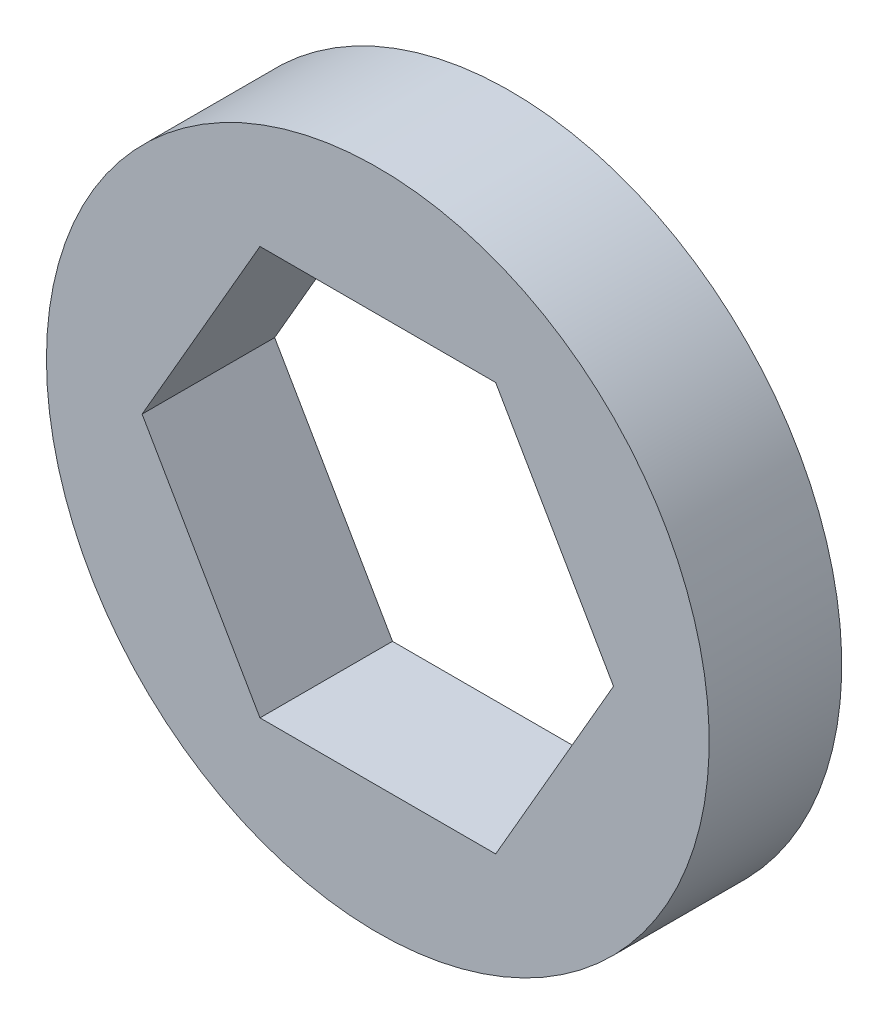
ISO-10303-21;
HEADER;
FILE_DESCRIPTION(('STEP AP214'),'2;1');
FILE_NAME('part.step','',(''),(''),'','','');
FILE_SCHEMA(('AUTOMOTIVE_DESIGN { 1 0 10303 214 1 1 1 1 }'));
ENDSEC;
DATA;
#1=APPLICATION_CONTEXT('core data for automotive mechanical design processes');
#2=APPLICATION_PROTOCOL_DEFINITION('international standard','automotive_design',2000,#1);
#3=PRODUCT_CONTEXT('',#1,'mechanical');
#4=PRODUCT('Part','Part','',(#3));
#5=PRODUCT_RELATED_PRODUCT_CATEGORY('part','',(#4));
#6=PRODUCT_DEFINITION_FORMATION('','',#4);
#7=PRODUCT_DEFINITION_CONTEXT('part definition',#1,'design');
#8=PRODUCT_DEFINITION('design','',#6,#7);
#9=PRODUCT_DEFINITION_SHAPE('','',#8);
#10=(LENGTH_UNIT() NAMED_UNIT(*) SI_UNIT(.MILLI.,.METRE.));
#11=(NAMED_UNIT(*) PLANE_ANGLE_UNIT() SI_UNIT($,.RADIAN.));
#12=(NAMED_UNIT(*) SI_UNIT($,.STERADIAN.) SOLID_ANGLE_UNIT());
#13=UNCERTAINTY_MEASURE_WITH_UNIT(LENGTH_MEASURE(1.E-05),#10,'distance_accuracy_value','');
#14=(GEOMETRIC_REPRESENTATION_CONTEXT(3) GLOBAL_UNCERTAINTY_ASSIGNED_CONTEXT((#13)) GLOBAL_UNIT_ASSIGNED_CONTEXT((#10,
#11,#12)) REPRESENTATION_CONTEXT('',''));
#15=CARTESIAN_POINT('',(0.,0.,0.));
#16=DIRECTION('',(0.,0.,1.));
#17=DIRECTION('',(1.,0.,0.));
#18=AXIS2_PLACEMENT_3D('',#15,#16,#17);
#19=CARTESIAN_POINT('',(0.,0.,-1.5875));
#20=DIRECTION('',(0.,0.,1.));
#21=DIRECTION('',(1.,0.,0.));
#22=AXIS2_PLACEMENT_3D('',#19,#20,#21);
#23=PLANE('',#22);
#24=DIRECTION('',(-0.5,-0.866025403784439,0.));
#25=VECTOR('',#24,1.);
#26=CARTESIAN_POINT('',(2.82295414120268,-4.8895,-1.5875));
#27=LINE('',#26,#25);
#28=CARTESIAN_POINT('',(5.64590828240535,0.,-1.5875));
#29=VERTEX_POINT('',#28);
#30=CARTESIAN_POINT('',(2.82295414120268,-4.8895,-1.5875));
#31=VERTEX_POINT('',#30);
#32=EDGE_CURVE('E74',#29,#31,#27,.T.);
#33=ORIENTED_EDGE('',*,*,#32,.F.);
#34=DIRECTION('',(0.500000000000001,-0.866025403784438,0.));
#35=VECTOR('',#34,1.);
#36=CARTESIAN_POINT('',(5.64590828240535,0.,-1.5875));
#37=LINE('',#36,#35);
#38=CARTESIAN_POINT('',(2.82295414120267,4.8895,-1.5875));
#39=VERTEX_POINT('',#38);
#40=EDGE_CURVE('E104',#39,#29,#37,.T.);
#41=ORIENTED_EDGE('',*,*,#40,.F.);
#42=DIRECTION('',(1.,0.,0.));
#43=VECTOR('',#42,1.);
#44=CARTESIAN_POINT('',(2.82295414120267,4.8895,-1.5875));
#45=LINE('',#44,#43);
#46=CARTESIAN_POINT('',(-2.82295414120268,4.8895,-1.5875));
#47=VERTEX_POINT('',#46);
#48=EDGE_CURVE('E112',#47,#39,#45,.T.);
#49=ORIENTED_EDGE('',*,*,#48,.F.);
#50=DIRECTION('',(0.5,0.866025403784439,0.));
#51=VECTOR('',#50,1.);
#52=CARTESIAN_POINT('',(-2.82295414120268,4.8895,-1.5875));
#53=LINE('',#52,#51);
#54=CARTESIAN_POINT('',(-5.64590828240535,0.,-1.5875));
#55=VERTEX_POINT('',#54);
#56=EDGE_CURVE('E117',#55,#47,#53,.T.);
#57=ORIENTED_EDGE('',*,*,#56,.F.);
#58=DIRECTION('',(-0.5,0.866025403784439,0.));
#59=VECTOR('',#58,1.);
#60=CARTESIAN_POINT('',(-5.64590828240535,0.,-1.5875));
#61=LINE('',#60,#59);
#62=CARTESIAN_POINT('',(-2.82295414120268,-4.8895,-1.5875));
#63=VERTEX_POINT('',#62);
#64=EDGE_CURVE('E69',#63,#55,#61,.T.);
#65=ORIENTED_EDGE('',*,*,#64,.F.);
#66=DIRECTION('',(-1.,0.,0.));
#67=VECTOR('',#66,1.);
#68=CARTESIAN_POINT('',(-2.82295414120268,-4.8895,-1.5875));
#69=LINE('',#68,#67);
#70=EDGE_CURVE('E71',#31,#63,#69,.T.);
#71=ORIENTED_EDGE('',*,*,#70,.F.);
#72=EDGE_LOOP('',(#33,#41,#49,#57,#65,#71));
#73=FACE_BOUND('',#72,.T.);
#74=CARTESIAN_POINT('',(0.,0.,-1.5875));
#75=DIRECTION('',(0.,0.,-1.));
#76=DIRECTION('',(-1.,0.,0.));
#77=AXIS2_PLACEMENT_3D('',#74,#75,#76);
#78=CIRCLE('',#77,7.9375);
#79=CARTESIAN_POINT('',(-7.9375,0.,-1.5875));
#80=VERTEX_POINT('',#79);
#81=EDGE_CURVE('E21',#80,#80,#78,.F.);
#82=ORIENTED_EDGE('',*,*,#81,.F.);
#83=EDGE_LOOP('',(#82));
#84=FACE_BOUND('',#83,.T.);
#85=ADVANCED_FACE('F18',(#73,#84),#23,.F.);
#86=CARTESIAN_POINT('',(0.,0.,1.5875));
#87=DIRECTION('',(0.,0.,-1.));
#88=DIRECTION('',(-1.,0.,0.));
#89=AXIS2_PLACEMENT_3D('',#86,#87,#88);
#90=CYLINDRICAL_SURFACE('',#89,7.9375);
#91=ORIENTED_EDGE('',*,*,#81,.T.);
#92=EDGE_LOOP('',(#91));
#93=FACE_BOUND('',#92,.T.);
#94=CARTESIAN_POINT('',(0.,0.,1.5875));
#95=DIRECTION('',(0.,0.,-1.));
#96=DIRECTION('',(-1.,0.,0.));
#97=AXIS2_PLACEMENT_3D('',#94,#95,#96);
#98=CIRCLE('',#97,7.9375);
#99=CARTESIAN_POINT('',(-7.9375,0.,1.5875));
#100=VERTEX_POINT('',#99);
#101=EDGE_CURVE('E96',#100,#100,#98,.F.);
#102=ORIENTED_EDGE('',*,*,#101,.F.);
#103=EDGE_LOOP('',(#102));
#104=FACE_BOUND('',#103,.T.);
#105=ADVANCED_FACE('F154',(#93,#104),#90,.T.);
#106=CARTESIAN_POINT('',(2.82295414120268,-4.8895,1.5875));
#107=DIRECTION('',(-0.866025403784439,0.5,0.));
#108=DIRECTION('',(-0.5,-0.866025403784439,0.));
#109=AXIS2_PLACEMENT_3D('',#106,#107,#108);
#110=PLANE('',#109);
#111=DIRECTION('',(-0.5,-0.866025403784439,0.));
#112=VECTOR('',#111,1.);
#113=CARTESIAN_POINT('',(5.64590828240535,0.,1.5875));
#114=LINE('',#113,#112);
#115=CARTESIAN_POINT('',(5.64590828240535,0.,1.5875));
#116=VERTEX_POINT('',#115);
#117=CARTESIAN_POINT('',(2.82295414120268,-4.8895,1.5875));
#118=VERTEX_POINT('',#117);
#119=EDGE_CURVE('E98',#116,#118,#114,.T.);
#120=ORIENTED_EDGE('',*,*,#119,.F.);
#121=DIRECTION('',(0.,0.,1.));
#122=VECTOR('',#121,1.);
#123=CARTESIAN_POINT('',(5.64590828240535,0.,1.5875));
#124=LINE('',#123,#122);
#125=EDGE_CURVE('E85',#29,#116,#124,.T.);
#126=ORIENTED_EDGE('',*,*,#125,.F.);
#127=ORIENTED_EDGE('',*,*,#32,.T.);
#128=DIRECTION('',(0.,0.,1.));
#129=VECTOR('',#128,1.);
#130=CARTESIAN_POINT('',(2.82295414120268,-4.8895,1.5875));
#131=LINE('',#130,#129);
#132=EDGE_CURVE('E79',#118,#31,#131,.F.);
#133=ORIENTED_EDGE('',*,*,#132,.F.);
#134=EDGE_LOOP('',(#120,#126,#127,#133));
#135=FACE_BOUND('',#134,.T.);
#136=ADVANCED_FACE('F82',(#135),#110,.T.);
#137=CARTESIAN_POINT('',(-2.82295414120268,-4.8895,1.5875));
#138=DIRECTION('',(0.,1.,0.));
#139=DIRECTION('',(-1.,0.,0.));
#140=AXIS2_PLACEMENT_3D('',#137,#138,#139);
#141=PLANE('',#140);
#142=DIRECTION('',(1.,0.,0.));
#143=VECTOR('',#142,1.);
#144=CARTESIAN_POINT('',(0.,-4.8895,1.5875));
#145=LINE('',#144,#143);
#146=CARTESIAN_POINT('',(-2.82295414120268,-4.8895,1.5875));
#147=VERTEX_POINT('',#146);
#148=EDGE_CURVE('E90',#118,#147,#145,.F.);
#149=ORIENTED_EDGE('',*,*,#148,.F.);
#150=ORIENTED_EDGE('',*,*,#132,.T.);
#151=ORIENTED_EDGE('',*,*,#70,.T.);
#152=DIRECTION('',(0.,0.,1.));
#153=VECTOR('',#152,1.);
#154=CARTESIAN_POINT('',(-2.82295414120268,-4.8895,1.5875));
#155=LINE('',#154,#153);
#156=EDGE_CURVE('E93',#147,#63,#155,.F.);
#157=ORIENTED_EDGE('',*,*,#156,.F.);
#158=EDGE_LOOP('',(#149,#150,#151,#157));
#159=FACE_BOUND('',#158,.T.);
#160=ADVANCED_FACE('F88',(#159),#141,.T.);
#161=CARTESIAN_POINT('',(-5.64590828240535,0.,1.5875));
#162=DIRECTION('',(0.866025403784439,0.5,0.));
#163=DIRECTION('',(-0.5,0.866025403784439,0.));
#164=AXIS2_PLACEMENT_3D('',#161,#162,#163);
#165=PLANE('',#164);
#166=DIRECTION('',(-0.5,0.866025403784439,0.));
#167=VECTOR('',#166,1.);
#168=CARTESIAN_POINT('',(-2.82295414120268,-4.8895,1.5875));
#169=LINE('',#168,#167);
#170=CARTESIAN_POINT('',(-5.64590828240535,0.,1.5875));
#171=VERTEX_POINT('',#170);
#172=EDGE_CURVE('E123',#147,#171,#169,.T.);
#173=ORIENTED_EDGE('',*,*,#172,.F.);
#174=ORIENTED_EDGE('',*,*,#156,.T.);
#175=ORIENTED_EDGE('',*,*,#64,.T.);
#176=DIRECTION('',(0.,0.,1.));
#177=VECTOR('',#176,1.);
#178=CARTESIAN_POINT('',(-5.64590828240535,0.,1.5875));
#179=LINE('',#178,#177);
#180=EDGE_CURVE('E114',#171,#55,#179,.F.);
#181=ORIENTED_EDGE('',*,*,#180,.F.);
#182=EDGE_LOOP('',(#173,#174,#175,#181));
#183=FACE_BOUND('',#182,.T.);
#184=ADVANCED_FACE('F121',(#183),#165,.T.);
#185=CARTESIAN_POINT('',(-2.82295414120268,4.8895,1.5875));
#186=DIRECTION('',(0.866025403784439,-0.5,0.));
#187=DIRECTION('',(0.5,0.866025403784439,0.));
#188=AXIS2_PLACEMENT_3D('',#185,#186,#187);
#189=PLANE('',#188);
#190=DIRECTION('',(0.5,0.866025403784439,0.));
#191=VECTOR('',#190,1.);
#192=CARTESIAN_POINT('',(-5.64590828240535,0.,1.5875));
#193=LINE('',#192,#191);
#194=CARTESIAN_POINT('',(-2.82295414120268,4.8895,1.5875));
#195=VERTEX_POINT('',#194);
#196=EDGE_CURVE('E127',#171,#195,#193,.T.);
#197=ORIENTED_EDGE('',*,*,#196,.F.);
#198=ORIENTED_EDGE('',*,*,#180,.T.);
#199=ORIENTED_EDGE('',*,*,#56,.T.);
#200=DIRECTION('',(0.,0.,1.));
#201=VECTOR('',#200,1.);
#202=CARTESIAN_POINT('',(-2.82295414120268,4.8895,1.5875));
#203=LINE('',#202,#201);
#204=EDGE_CURVE('E109',#195,#47,#203,.F.);
#205=ORIENTED_EDGE('',*,*,#204,.F.);
#206=EDGE_LOOP('',(#197,#198,#199,#205));
#207=FACE_BOUND('',#206,.T.);
#208=ADVANCED_FACE('F135',(#207),#189,.T.);
#209=CARTESIAN_POINT('',(2.82295414120267,4.8895,1.5875));
#210=DIRECTION('',(0.,-1.,0.));
#211=DIRECTION('',(1.,0.,0.));
#212=AXIS2_PLACEMENT_3D('',#209,#210,#211);
#213=PLANE('',#212);
#214=DIRECTION('',(1.,0.,0.));
#215=VECTOR('',#214,1.);
#216=CARTESIAN_POINT('',(0.,4.8895,1.5875));
#217=LINE('',#216,#215);
#218=CARTESIAN_POINT('',(2.82295414120267,4.8895,1.5875));
#219=VERTEX_POINT('',#218);
#220=EDGE_CURVE('E27',#195,#219,#217,.T.);
#221=ORIENTED_EDGE('',*,*,#220,.F.);
#222=ORIENTED_EDGE('',*,*,#204,.T.);
#223=ORIENTED_EDGE('',*,*,#48,.T.);
#224=DIRECTION('',(0.,0.,1.));
#225=VECTOR('',#224,1.);
#226=CARTESIAN_POINT('',(2.82295414120267,4.8895,1.5875));
#227=LINE('',#226,#225);
#228=EDGE_CURVE('E36',#219,#39,#227,.F.);
#229=ORIENTED_EDGE('',*,*,#228,.F.);
#230=EDGE_LOOP('',(#221,#222,#223,#229));
#231=FACE_BOUND('',#230,.T.);
#232=ADVANCED_FACE('F133',(#231),#213,.T.);
#233=CARTESIAN_POINT('',(5.64590828240535,0.,1.5875));
#234=DIRECTION('',(-0.866025403784438,-0.500000000000001,0.));
#235=DIRECTION('',(0.500000000000001,-0.866025403784438,0.));
#236=AXIS2_PLACEMENT_3D('',#233,#234,#235);
#237=PLANE('',#236);
#238=DIRECTION('',(0.5,-0.866025403784438,0.));
#239=VECTOR('',#238,1.);
#240=CARTESIAN_POINT('',(2.82295414120267,4.8895,1.5875));
#241=LINE('',#240,#239);
#242=EDGE_CURVE('E11',#219,#116,#241,.T.);
#243=ORIENTED_EDGE('',*,*,#242,.F.);
#244=ORIENTED_EDGE('',*,*,#228,.T.);
#245=ORIENTED_EDGE('',*,*,#40,.T.);
#246=ORIENTED_EDGE('',*,*,#125,.T.);
#247=EDGE_LOOP('',(#243,#244,#245,#246));
#248=FACE_BOUND('',#247,.T.);
#249=ADVANCED_FACE('F136',(#248),#237,.T.);
#250=CARTESIAN_POINT('',(0.,0.,1.5875));
#251=DIRECTION('',(0.,0.,1.));
#252=DIRECTION('',(1.,0.,0.));
#253=AXIS2_PLACEMENT_3D('',#250,#251,#252);
#254=PLANE('',#253);
#255=ORIENTED_EDGE('',*,*,#220,.T.);
#256=ORIENTED_EDGE('',*,*,#242,.T.);
#257=ORIENTED_EDGE('',*,*,#119,.T.);
#258=ORIENTED_EDGE('',*,*,#148,.T.);
#259=ORIENTED_EDGE('',*,*,#172,.T.);
#260=ORIENTED_EDGE('',*,*,#196,.T.);
#261=EDGE_LOOP('',(#255,#256,#257,#258,#259,#260));
#262=FACE_BOUND('',#261,.T.);
#263=ORIENTED_EDGE('',*,*,#101,.T.);
#264=EDGE_LOOP('',(#263));
#265=FACE_BOUND('',#264,.T.);
#266=ADVANCED_FACE('F130',(#262,#265),#254,.T.);
#267=CLOSED_SHELL('',(#85,#105,#136,#160,#184,#208,#232,#249,#266));
#268=MANIFOLD_SOLID_BREP('B1',#267);
#269=ADVANCED_BREP_SHAPE_REPRESENTATION('',(#18,#268),#14);
#270=SHAPE_DEFINITION_REPRESENTATION(#9,#269);
ENDSEC;
END-ISO-10303-21;
